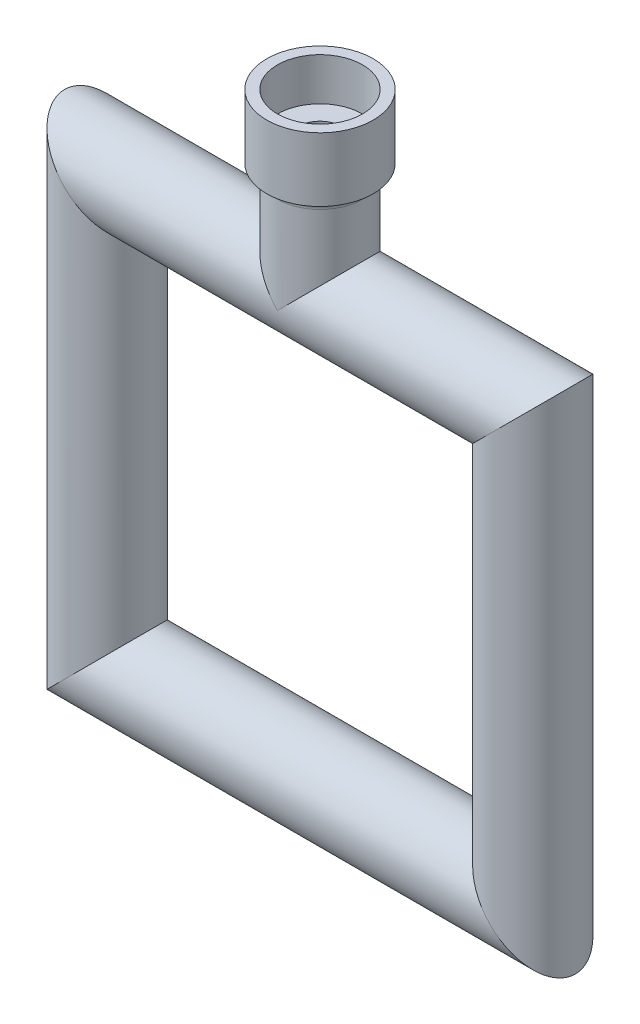
ISO-10303-21;
HEADER;
FILE_DESCRIPTION(('STEP AP214'),'2;1');
FILE_NAME('part.step','',(''),(''),'','','');
FILE_SCHEMA(('AUTOMOTIVE_DESIGN { 1 0 10303 214 1 1 1 1 }'));
ENDSEC;
DATA;
#1=APPLICATION_CONTEXT('core data for automotive mechanical design processes');
#2=APPLICATION_PROTOCOL_DEFINITION('international standard','automotive_design',2000,#1);
#3=PRODUCT_CONTEXT('',#1,'mechanical');
#4=PRODUCT('Part','Part','',(#3));
#5=PRODUCT_RELATED_PRODUCT_CATEGORY('part','',(#4));
#6=PRODUCT_DEFINITION_FORMATION('','',#4);
#7=PRODUCT_DEFINITION_CONTEXT('part definition',#1,'design');
#8=PRODUCT_DEFINITION('design','',#6,#7);
#9=PRODUCT_DEFINITION_SHAPE('','',#8);
#10=(LENGTH_UNIT() NAMED_UNIT(*) SI_UNIT(.MILLI.,.METRE.));
#11=(NAMED_UNIT(*) PLANE_ANGLE_UNIT() SI_UNIT($,.RADIAN.));
#12=(NAMED_UNIT(*) SI_UNIT($,.STERADIAN.) SOLID_ANGLE_UNIT());
#13=UNCERTAINTY_MEASURE_WITH_UNIT(LENGTH_MEASURE(1.E-05),#10,'distance_accuracy_value','');
#14=(GEOMETRIC_REPRESENTATION_CONTEXT(3) GLOBAL_UNCERTAINTY_ASSIGNED_CONTEXT((#13)) GLOBAL_UNIT_ASSIGNED_CONTEXT((#10,
#11,#12)) REPRESENTATION_CONTEXT('',''));
#15=CARTESIAN_POINT('',(0.,0.,0.));
#16=DIRECTION('',(0.,0.,1.));
#17=DIRECTION('',(1.,0.,0.));
#18=AXIS2_PLACEMENT_3D('',#15,#16,#17);
#19=CARTESIAN_POINT('',(-132.062548693336,95.4082453020949,0.));
#20=DIRECTION('',(0.,-1.,0.));
#21=DIRECTION('',(0.,0.,-1.));
#22=AXIS2_PLACEMENT_3D('',#19,#20,#21);
#23=CYLINDRICAL_SURFACE('',#22,8.00000000000001);
#24=CARTESIAN_POINT('',(-132.062548693336,77.7082453020949,0.));
#25=DIRECTION('',(0.707106781186548,-0.707106781186547,0.));
#26=DIRECTION('',(0.707106781186547,0.707106781186548,0.));
#27=AXIS2_PLACEMENT_3D('',#24,#25,#26);
#28=ELLIPSE('',#27,11.3137084989848,8.00000000000001);
#29=CARTESIAN_POINT('',(-124.062548693336,85.7082453020949,0.));
#30=VERTEX_POINT('',#29);
#31=EDGE_CURVE('E82',#30,#30,#28,.F.);
#32=ORIENTED_EDGE('',*,*,#31,.F.);
#33=EDGE_LOOP('',(#32));
#34=FACE_BOUND('',#33,.T.);
#35=CARTESIAN_POINT('',(-132.062548693336,-2.29175469790497,0.));
#36=DIRECTION('',(-0.707106781186547,-0.707106781186548,0.));
#37=DIRECTION('',(-0.707106781186548,0.707106781186547,0.));
#38=AXIS2_PLACEMENT_3D('',#35,#36,#37);
#39=ELLIPSE('',#38,11.3137084989848,8.00000000000001);
#40=CARTESIAN_POINT('',(-140.062548693336,5.70824530209504,0.));
#41=VERTEX_POINT('',#40);
#42=EDGE_CURVE('E61',#41,#41,#39,.F.);
#43=ORIENTED_EDGE('',*,*,#42,.T.);
#44=EDGE_LOOP('',(#43));
#45=FACE_BOUND('',#44,.T.);
#46=ADVANCED_FACE('F44',(#34,#45),#23,.T.);
#47=CARTESIAN_POINT('',(-114.362548693336,-2.29175469790496,0.));
#48=DIRECTION('',(-1.,0.,0.));
#49=DIRECTION('',(0.,-1.,0.));
#50=AXIS2_PLACEMENT_3D('',#47,#48,#49);
#51=CYLINDRICAL_SURFACE('',#50,8.00000000000001);
#52=ORIENTED_EDGE('',*,*,#42,.F.);
#53=EDGE_LOOP('',(#52));
#54=FACE_BOUND('',#53,.T.);
#55=CARTESIAN_POINT('',(-212.062548693336,-2.29175469790503,0.));
#56=DIRECTION('',(-0.707106781186548,0.707106781186547,0.));
#57=DIRECTION('',(0.707106781186547,0.707106781186548,0.));
#58=AXIS2_PLACEMENT_3D('',#55,#56,#57);
#59=ELLIPSE('',#58,11.3137084989848,8.00000000000001);
#60=CARTESIAN_POINT('',(-204.062548693336,5.70824530209497,0.));
#61=VERTEX_POINT('',#60);
#62=EDGE_CURVE('E78',#61,#61,#59,.F.);
#63=ORIENTED_EDGE('',*,*,#62,.T.);
#64=EDGE_LOOP('',(#63));
#65=FACE_BOUND('',#64,.T.);
#66=ADVANCED_FACE('F151',(#54,#65),#51,.T.);
#67=CARTESIAN_POINT('',(-229.762548693336,77.7082453020949,0.));
#68=DIRECTION('',(1.,0.,0.));
#69=DIRECTION('',(0.,1.,0.));
#70=AXIS2_PLACEMENT_3D('',#67,#68,#69);
#71=CYLINDRICAL_SURFACE('',#70,8.00000000000001);
#72=CARTESIAN_POINT('',(-172.062548693336,70.7800420718194,3.99999999999999));
#73=CARTESIAN_POINT('',(-171.958283367898,70.7800414394666,3.99999950219344));
#74=CARTESIAN_POINT('',(-171.854008766656,70.77768018753,3.99591763199539));
#75=CARTESIAN_POINT('',(-171.646264518735,70.7683235774563,3.97964472112406));
#76=CARTESIAN_POINT('',(-171.542795269503,70.7613260619101,3.96744990521397));
#77=CARTESIAN_POINT('',(-171.337337847766,70.7429420016429,3.93508538297521));
#78=CARTESIAN_POINT('',(-171.235352259506,70.7315485739323,3.91490316893162));
#79=CARTESIAN_POINT('',(-171.033734691657,70.7047855676199,3.86682062971257));
#80=CARTESIAN_POINT('',(-170.934103755293,70.689414261375,3.83891695064121));
#81=CARTESIAN_POINT('',(-170.640859727327,70.6382798842373,3.74442772916633));
#82=CARTESIAN_POINT('',(-170.451562836719,70.5973662542617,3.66684915651284));
#83=CARTESIAN_POINT('',(-170.088819129535,70.5065360225742,3.48506075380107));
#84=CARTESIAN_POINT('',(-169.915373171116,70.4566189338563,3.38084948302615));
#85=CARTESIAN_POINT('',(-169.573340198988,70.3483730394541,3.13867639492104));
#86=CARTESIAN_POINT('',(-169.406333826888,70.2896900191959,2.99863981046007));
#87=CARTESIAN_POINT('',(-169.096893452686,70.1733587244371,2.69298354883074));
#88=CARTESIAN_POINT('',(-168.954471707572,70.1157109788448,2.52735118809492));
#89=CARTESIAN_POINT('',(-168.757566626854,70.0323693664984,2.2562643781099));
#90=CARTESIAN_POINT('',(-168.693016431717,70.0042961096927,2.15870290429514));
#91=CARTESIAN_POINT('',(-168.572444253108,69.9508033641343,1.95777427065882));
#92=CARTESIAN_POINT('',(-168.516418647327,69.925382749659,1.85440960246323));
#93=CARTESIAN_POINT('',(-168.413435911678,69.8779237029121,1.64251485422606));
#94=CARTESIAN_POINT('',(-168.366478640746,69.85588521803,1.53398485456801));
#95=CARTESIAN_POINT('',(-168.28218674507,69.8158591047757,1.31258580967488));
#96=CARTESIAN_POINT('',(-168.244846705646,69.7978691977025,1.19971924732414));
#97=CARTESIAN_POINT('',(-168.182530399061,69.767599566188,0.978622575683235));
#98=CARTESIAN_POINT('',(-168.156866540277,69.7550060020258,0.870629018183683));
#99=CARTESIAN_POINT('',(-168.114568985902,69.7341494634817,0.652524088435713));
#100=CARTESIAN_POINT('',(-168.09793087182,69.7258843701956,0.542413779814401));
#101=CARTESIAN_POINT('',(-168.073892826338,69.713918142569,0.320973525125326));
#102=CARTESIAN_POINT('',(-168.06649024662,69.7102156998776,0.209643937931218));
#103=CARTESIAN_POINT('',(-168.061017006966,69.7074797016465,-0.0132971447801825));
#104=CARTESIAN_POINT('',(-168.062945776091,69.7084458604578,-0.124908622632323));
#105=CARTESIAN_POINT('',(-168.075533902043,69.7147316974531,-0.33772798534243));
#106=CARTESIAN_POINT('',(-168.085416715685,69.7196641180081,-0.438993817716943));
#107=CARTESIAN_POINT('',(-168.112811972432,69.7332665019751,-0.640243249291355));
#108=CARTESIAN_POINT('',(-168.130326872472,69.7419376689614,-0.740226424897066));
#109=CARTESIAN_POINT('',(-168.19405921603,69.7732733471094,-1.03714138295469));
#110=CARTESIAN_POINT('',(-168.251476590337,69.8012665413868,-1.23123936013571));
#111=CARTESIAN_POINT('',(-168.394882667221,69.8693825769154,-1.60926871560141));
#112=CARTESIAN_POINT('',(-168.481255675739,69.9096678786622,-1.79302228049015));
#113=CARTESIAN_POINT('',(-168.679600627807,69.998739224807,-2.14389861654609));
#114=CARTESIAN_POINT('',(-168.79158173615,70.0475283111047,-2.31101540282593));
#115=CARTESIAN_POINT('',(-169.050133613333,70.1544699033993,-2.64069813790284));
#116=CARTESIAN_POINT('',(-169.198973453489,70.2130715576811,-2.80134064782814));
#117=CARTESIAN_POINT('',(-169.520894936522,70.3300703821172,-3.09641313015099));
#118=CARTESIAN_POINT('',(-169.69399505616,70.3884673613146,-3.23082293513641));
#119=CARTESIAN_POINT('',(-170.073191582004,70.5024841740141,-3.47803613314162));
#120=CARTESIAN_POINT('',(-170.280685311883,70.5576921482639,-3.58892539602577));
#121=CARTESIAN_POINT('',(-170.605966077775,70.6293760479291,-3.72723782010753));
#122=CARTESIAN_POINT('',(-170.716757052533,70.6514193636003,-3.76867730715225));
#123=CARTESIAN_POINT('',(-170.942293540117,70.6909323057295,-3.84175062064905));
#124=CARTESIAN_POINT('',(-171.057036565862,70.7084047512665,-3.87339049322798));
#125=CARTESIAN_POINT('',(-171.280377357853,70.7368392761062,-3.92431909326375));
#126=CARTESIAN_POINT('',(-171.388747344796,70.7482057320169,-3.94438433855718));
#127=CARTESIAN_POINT('',(-171.607129593814,70.7659419466536,-3.97551851361913));
#128=CARTESIAN_POINT('',(-171.71714097147,70.7723143038045,-3.98659212183613));
#129=CARTESIAN_POINT('',(-171.937841203368,70.7797971829957,-3.99958291311108));
#130=CARTESIAN_POINT('',(-172.048529789963,70.7809096643432,-4.00150350567567));
#131=CARTESIAN_POINT('',(-172.269605386441,70.7778299103454,-3.99616718095744));
#132=CARTESIAN_POINT('',(-172.379992416178,70.7736380330655,-3.98891088315149));
#133=CARTESIAN_POINT('',(-172.587418077315,70.7608733300611,-3.96663154579714));
#134=CARTESIAN_POINT('',(-172.684591904348,70.7528318888324,-3.95254845698989));
#135=CARTESIAN_POINT('',(-172.87728062677,70.7329615753745,-3.91737385475212));
#136=CARTESIAN_POINT('',(-172.972794963372,70.7211314525079,-3.89628002700135));
#137=CARTESIAN_POINT('',(-173.255916729444,70.6804884430794,-3.82280238446313));
#138=CARTESIAN_POINT('',(-173.440240127608,70.6465136651611,-3.76020731695077));
#139=CARTESIAN_POINT('',(-173.804223281037,70.5667953691745,-3.60658595732553));
#140=CARTESIAN_POINT('',(-173.983271646675,70.5205796586267,-3.51437713951605));
#141=CARTESIAN_POINT('',(-174.324418890023,70.4220004359063,-3.30514737086265));
#142=CARTESIAN_POINT('',(-174.486508996644,70.3696337717905,-3.18811367399406));
#143=CARTESIAN_POINT('',(-174.810461816194,70.256726935925,-2.91535761342626));
#144=CARTESIAN_POINT('',(-174.969720280502,70.1959885511683,-2.75661800037807));
#145=CARTESIAN_POINT('',(-175.260214666752,70.0788693255175,-2.41358105803053));
#146=CARTESIAN_POINT('',(-175.391441122952,70.0224899606482,-2.22927513013697));
#147=CARTESIAN_POINT('',(-175.565756475573,69.9448898627111,-1.93419225408144));
#148=CARTESIAN_POINT('',(-175.620678750635,69.9199017600682,-1.83122945254022));
#149=CARTESIAN_POINT('',(-175.721554224213,69.8733034628416,-1.62028527572797));
#150=CARTESIAN_POINT('',(-175.767511456474,69.8516917499559,-1.51230618469742));
#151=CARTESIAN_POINT('',(-175.849923019976,69.8124937819428,-1.29213403393067));
#152=CARTESIAN_POINT('',(-175.886381851515,69.7949056209582,-1.17994299872754));
#153=CARTESIAN_POINT('',(-175.949355954282,69.7642845927613,-0.952197786601984));
#154=CARTESIAN_POINT('',(-175.97587240463,69.7512511853883,-0.836644010238128));
#155=CARTESIAN_POINT('',(-176.016620743283,69.731127810837,-0.613942900584697));
#156=CARTESIAN_POINT('',(-176.031758166112,69.7236014624309,-0.506999857370271));
#157=CARTESIAN_POINT('',(-176.053340806688,69.7128508048039,-0.291983714868727));
#158=CARTESIAN_POINT('',(-176.059783129707,69.7096279282774,-0.183910251308578));
#159=CARTESIAN_POINT('',(-176.063878835421,69.7075803383906,0.0323692027916302));
#160=CARTESIAN_POINT('',(-176.06153830492,69.7087525790707,0.140575049615288));
#161=CARTESIAN_POINT('',(-176.04811102251,69.7154564588488,0.356345776551111));
#162=CARTESIAN_POINT('',(-176.037021065472,69.7209896954851,0.463910407218418));
#163=CARTESIAN_POINT('',(-176.007254715945,69.7357582516915,0.670402230454414));
#164=CARTESIAN_POINT('',(-175.989130844632,69.7447234126341,0.769428771379722));
#165=CARTESIAN_POINT('',(-175.945578755848,69.7661064717151,0.965494016558233));
#166=CARTESIAN_POINT('',(-175.920148044162,69.7785255488131,1.06253202988244));
#167=CARTESIAN_POINT('',(-175.833262097585,69.8205549391269,1.34967669515382));
#168=CARTESIAN_POINT('',(-175.761187153176,69.8549507612641,1.535990515319));
#169=CARTESIAN_POINT('',(-175.587634916055,69.9352098402071,1.90172389087137));
#170=CARTESIAN_POINT('',(-175.485031921002,69.9815006430211,2.08050775123498));
#171=CARTESIAN_POINT('',(-175.254716449163,70.0807199475304,2.41909138351715));
#172=CARTESIAN_POINT('',(-175.126992439703,70.1336514938325,2.57888238184508));
#173=CARTESIAN_POINT('',(-174.835368556458,70.2470990743441,2.89165430996829));
#174=CARTESIAN_POINT('',(-174.6691334665,70.3078456699643,3.04237488708291));
#175=CARTESIAN_POINT('',(-174.312711055164,70.4257299339999,3.31466901461283));
#176=CARTESIAN_POINT('',(-174.122502768086,70.482864376931,3.43621677845464));
#177=CARTESIAN_POINT('',(-173.819172957183,70.5615149743789,3.59554085555899));
#178=CARTESIAN_POINT('',(-173.713247625067,70.5868957157142,3.64540546855454));
#179=CARTESIAN_POINT('',(-173.496744316371,70.6339415256285,3.73588341660289));
#180=CARTESIAN_POINT('',(-173.386168771274,70.6556085066871,3.77650151690076));
#181=CARTESIAN_POINT('',(-173.161422393903,70.6943090952248,3.84790167044829));
#182=CARTESIAN_POINT('',(-173.047261658868,70.711354605176,3.87870902746064));
#183=CARTESIAN_POINT('',(-172.816074977759,70.7401270239027,3.93016568856617));
#184=CARTESIAN_POINT('',(-172.699051095248,70.7518576508056,3.95082209480823));
#185=CARTESIAN_POINT('',(-172.495350383792,70.767064973204,3.97745846425996));
#186=CARTESIAN_POINT('',(-172.409089320354,70.7719195464748,3.98590343866332));
#187=CARTESIAN_POINT('',(-172.23607056535,70.778408466601,3.99717460159987));
#188=CARTESIAN_POINT('',(-172.14931284095,70.7800425980303,4.00000041424856));
#189=CARTESIAN_POINT('',(-172.062548693336,70.7800420718194,3.99999999999999));
#190=B_SPLINE_CURVE_WITH_KNOTS('',3,(#72,#73,#74,#75,#76,#77,#78,#79,#80,#81,#82,#83,#84,#85,
#86,#87,#88,#89,#90,#91,#92,#93,#94,#95,#96,#97,#98,#99,#100,#101,#102,#103,#104,#105,#106,#107,
#108,#109,#110,#111,#112,#113,#114,#115,#116,#117,#118,#119,#120,#121,#122,#123,#124,#125,#126,
#127,#128,#129,#130,#131,#132,#133,#134,#135,#136,#137,#138,#139,#140,#141,#142,#143,#144,#145,
#146,#147,#148,#149,#150,#151,#152,#153,#154,#155,#156,#157,#158,#159,#160,#161,#162,#163,#164,
#165,#166,#167,#168,#169,#170,#171,#172,#173,#174,#175,#176,#177,#178,#179,#180,#181,#182,#183,
#184,#185,#186,#187,#188,#189),.UNSPECIFIED.,.T.,.F.,(4,2,2,2,2,2,2,2,2,2,2,2,2,2,2,2,2,2,2,2,2,
2,2,2,2,2,2,2,2,2,2,2,2,2,2,2,2,2,2,2,2,2,2,2,2,2,2,2,2,2,2,2,2,2,2,2,2,2,4),(0.,
0.312705907645182,0.625557430139051,0.938900807369715,1.25238050266336,1.87532331508722,
2.49829983322607,3.17265818143841,3.8473517748203,4.20786878872691,4.56823217961299,
4.92858996431117,5.28874441516655,5.62343001077675,5.95795161516747,6.29237727234832,
6.62678246790365,6.93200651230819,7.23732888766058,7.84737748897725,8.46586637752492,
9.08457696228991,9.76177264655466,10.4394869181158,11.1602386574569,11.5207615871967,
11.8810616378013,12.2129840588139,12.5447336660446,12.8763596865808,13.2079633222265,
13.5031682056197,13.7984706362685,14.38866539675,15.006195155551,15.6240427481094,
16.319773042532,17.0157378984356,17.3733524504477,17.7308057238246,18.0880893282017,
18.44533054695,18.7697157004161,19.0942088199643,19.4184770967801,19.7428642161658,
20.0457160884446,20.3486714633267,20.9540518089476,21.5853244972459,22.2168876724958,
22.9113041424697,23.6063321822732,23.9652997079033,24.3240818165631,24.6819309195695,
25.0395292944428,25.2997293817866,25.5599468741983),.UNSPECIFIED.);
#191=CARTESIAN_POINT('',(-172.062548693336,70.7800420718194,3.99999999999999));
#192=VERTEX_POINT('',#191);
#193=EDGE_CURVE('E105',#192,#192,#190,.T.);
#194=ORIENTED_EDGE('',*,*,#193,.T.);
#195=EDGE_LOOP('',(#194));
#196=FACE_BOUND('',#195,.T.);
#197=CARTESIAN_POINT('',(-172.062548693336,77.7082453020949,0.));
#198=DIRECTION('',(0.707106781186548,-0.707106781186547,0.));
#199=DIRECTION('',(0.707106781186547,0.707106781186548,0.));
#200=AXIS2_PLACEMENT_3D('',#197,#198,#199);
#201=ELLIPSE('',#200,11.3137084989848,8.);
#202=CARTESIAN_POINT('',(-172.062548693336,77.7082453020949,8.));
#203=VERTEX_POINT('',#202);
#204=CARTESIAN_POINT('',(-172.062548693336,77.7082453020949,-8.));
#205=VERTEX_POINT('',#204);
#206=EDGE_CURVE('E12',#203,#205,#201,.F.);
#207=ORIENTED_EDGE('',*,*,#206,.F.);
#208=CARTESIAN_POINT('',(-172.062548693336,77.7082453020949,0.));
#209=DIRECTION('',(0.707106781186547,0.707106781186548,0.));
#210=DIRECTION('',(0.707106781186548,-0.707106781186547,0.));
#211=AXIS2_PLACEMENT_3D('',#208,#209,#210);
#212=ELLIPSE('',#211,11.3137084989848,8.);
#213=EDGE_CURVE('E51',#205,#203,#212,.T.);
#214=ORIENTED_EDGE('',*,*,#213,.F.);
#215=EDGE_LOOP('',(#207,#214));
#216=FACE_BOUND('',#215,.T.);
#217=CARTESIAN_POINT('',(-212.062548693336,77.708245302095,0.));
#218=DIRECTION('',(0.707106781186547,0.707106781186548,0.));
#219=DIRECTION('',(-0.707106781186548,0.707106781186547,0.));
#220=AXIS2_PLACEMENT_3D('',#217,#218,#219);
#221=ELLIPSE('',#220,11.3137084989848,8.00000000000001);
#222=CARTESIAN_POINT('',(-220.062548693336,85.708245302095,0.));
#223=VERTEX_POINT('',#222);
#224=EDGE_CURVE('E76',#223,#223,#221,.F.);
#225=ORIENTED_EDGE('',*,*,#224,.F.);
#226=EDGE_LOOP('',(#225));
#227=FACE_BOUND('',#226,.T.);
#228=ORIENTED_EDGE('',*,*,#31,.T.);
#229=EDGE_LOOP('',(#228));
#230=FACE_BOUND('',#229,.T.);
#231=ADVANCED_FACE('F72',(#196,#216,#227,#230),#71,.T.);
#232=CARTESIAN_POINT('',(-212.062548693336,-19.9917546979051,0.));
#233=DIRECTION('',(0.,1.,0.));
#234=DIRECTION('',(0.,0.,1.));
#235=AXIS2_PLACEMENT_3D('',#232,#233,#234);
#236=CYLINDRICAL_SURFACE('',#235,8.00000000000001);
#237=ORIENTED_EDGE('',*,*,#62,.F.);
#238=EDGE_LOOP('',(#237));
#239=FACE_BOUND('',#238,.T.);
#240=ORIENTED_EDGE('',*,*,#224,.T.);
#241=EDGE_LOOP('',(#240));
#242=FACE_BOUND('',#241,.T.);
#243=ADVANCED_FACE('F145',(#239,#242),#236,.T.);
#244=CARTESIAN_POINT('',(-172.062548693336,29.5523789677077,0.));
#245=DIRECTION('',(0.,-1.,0.));
#246=DIRECTION('',(0.,0.,-1.));
#247=AXIS2_PLACEMENT_3D('',#244,#245,#246);
#248=CYLINDRICAL_SURFACE('',#247,8.);
#249=CARTESIAN_POINT('',(-172.062548693336,95.8082453020949,0.));
#250=DIRECTION('',(0.,-1.,0.));
#251=DIRECTION('',(0.,0.,-1.));
#252=AXIS2_PLACEMENT_3D('',#249,#250,#251);
#253=CIRCLE('',#252,8.);
#254=CARTESIAN_POINT('',(-172.062548693336,95.8082453020949,-8.));
#255=VERTEX_POINT('',#254);
#256=EDGE_CURVE('E83',#255,#255,#253,.T.);
#257=ORIENTED_EDGE('',*,*,#256,.T.);
#258=EDGE_LOOP('',(#257));
#259=FACE_BOUND('',#258,.T.);
#260=ORIENTED_EDGE('',*,*,#213,.T.);
#261=ORIENTED_EDGE('',*,*,#206,.T.);
#262=EDGE_LOOP('',(#260,#261));
#263=FACE_BOUND('',#262,.T.);
#264=ADVANCED_FACE('F75',(#259,#263),#248,.T.);
#265=CARTESIAN_POINT('',(-172.062548693336,95.8082453020949,0.));
#266=DIRECTION('',(0.,-1.,0.));
#267=DIRECTION('',(0.,0.,-1.));
#268=AXIS2_PLACEMENT_3D('',#265,#266,#267);
#269=TOROIDAL_SURFACE('',#268,9.9,1.9);
#270=CARTESIAN_POINT('',(-172.062548693336,97.7082453020949,0.));
#271=DIRECTION('',(0.,-1.,0.));
#272=DIRECTION('',(0.,0.,-1.));
#273=AXIS2_PLACEMENT_3D('',#270,#271,#272);
#274=CIRCLE('',#273,9.90000000000001);
#275=CARTESIAN_POINT('',(-172.062548693336,97.7082453020949,-9.90000000000001));
#276=VERTEX_POINT('',#275);
#277=EDGE_CURVE('E89',#276,#276,#274,.T.);
#278=ORIENTED_EDGE('',*,*,#277,.T.);
#279=EDGE_LOOP('',(#278));
#280=FACE_BOUND('',#279,.T.);
#281=ORIENTED_EDGE('',*,*,#256,.F.);
#282=EDGE_LOOP('',(#281));
#283=FACE_BOUND('',#282,.T.);
#284=ADVANCED_FACE('F138',(#280,#283),#269,.F.);
#285=CARTESIAN_POINT('',(-172.062548693336,97.7082453020949,-9.99999999999999));
#286=DIRECTION('',(0.,-1.,0.));
#287=DIRECTION('',(0.,0.,-1.));
#288=AXIS2_PLACEMENT_3D('',#285,#286,#287);
#289=PLANE('',#288);
#290=CARTESIAN_POINT('',(-172.062548693336,97.7082453020949,0.));
#291=DIRECTION('',(0.,-1.,0.));
#292=DIRECTION('',(0.,0.,-1.));
#293=AXIS2_PLACEMENT_3D('',#290,#291,#292);
#294=CIRCLE('',#293,9.99999999999999);
#295=CARTESIAN_POINT('',(-172.062548693336,97.7082453020949,-9.99999999999999));
#296=VERTEX_POINT('',#295);
#297=EDGE_CURVE('E92',#296,#296,#294,.T.);
#298=ORIENTED_EDGE('',*,*,#297,.T.);
#299=EDGE_LOOP('',(#298));
#300=FACE_BOUND('',#299,.T.);
#301=ORIENTED_EDGE('',*,*,#277,.F.);
#302=EDGE_LOOP('',(#301));
#303=FACE_BOUND('',#302,.T.);
#304=ADVANCED_FACE('F134',(#300,#303),#289,.T.);
#305=CARTESIAN_POINT('',(-172.062548693336,29.5523789677077,0.));
#306=DIRECTION('',(0.,-1.,0.));
#307=DIRECTION('',(0.,0.,-1.));
#308=AXIS2_PLACEMENT_3D('',#305,#306,#307);
#309=CYLINDRICAL_SURFACE('',#308,9.99999999999999);
#310=CARTESIAN_POINT('',(-172.062548693336,109.708245302095,0.));
#311=DIRECTION('',(0.,-1.,0.));
#312=DIRECTION('',(0.,0.,-1.));
#313=AXIS2_PLACEMENT_3D('',#310,#311,#312);
#314=CIRCLE('',#313,9.99999999999999);
#315=CARTESIAN_POINT('',(-172.062548693336,109.708245302095,-9.99999999999999));
#316=VERTEX_POINT('',#315);
#317=EDGE_CURVE('E95',#316,#316,#314,.T.);
#318=ORIENTED_EDGE('',*,*,#317,.T.);
#319=EDGE_LOOP('',(#318));
#320=FACE_BOUND('',#319,.T.);
#321=ORIENTED_EDGE('',*,*,#297,.F.);
#322=EDGE_LOOP('',(#321));
#323=FACE_BOUND('',#322,.T.);
#324=ADVANCED_FACE('F130',(#320,#323),#309,.T.);
#325=CARTESIAN_POINT('',(-172.062548693336,109.708245302095,-7.99999999999999));
#326=DIRECTION('',(0.,1.,0.));
#327=DIRECTION('',(0.,0.,1.));
#328=AXIS2_PLACEMENT_3D('',#325,#326,#327);
#329=PLANE('',#328);
#330=CARTESIAN_POINT('',(-172.062548693336,109.708245302095,0.));
#331=DIRECTION('',(0.,-1.,0.));
#332=DIRECTION('',(0.,0.,-1.));
#333=AXIS2_PLACEMENT_3D('',#330,#331,#332);
#334=CIRCLE('',#333,7.99999999999999);
#335=CARTESIAN_POINT('',(-172.062548693336,109.708245302095,-7.99999999999999));
#336=VERTEX_POINT('',#335);
#337=EDGE_CURVE('E98',#336,#336,#334,.T.);
#338=ORIENTED_EDGE('',*,*,#337,.T.);
#339=EDGE_LOOP('',(#338));
#340=FACE_BOUND('',#339,.T.);
#341=ORIENTED_EDGE('',*,*,#317,.F.);
#342=EDGE_LOOP('',(#341));
#343=FACE_BOUND('',#342,.T.);
#344=ADVANCED_FACE('F126',(#340,#343),#329,.T.);
#345=CARTESIAN_POINT('',(-172.062548693336,29.5523789677077,0.));
#346=DIRECTION('',(0.,-1.,0.));
#347=DIRECTION('',(0.,0.,-1.));
#348=AXIS2_PLACEMENT_3D('',#345,#346,#347);
#349=CYLINDRICAL_SURFACE('',#348,7.99999999999999);
#350=CARTESIAN_POINT('',(-172.062548693336,101.708245302095,0.));
#351=DIRECTION('',(0.,-1.,0.));
#352=DIRECTION('',(0.,0.,-1.));
#353=AXIS2_PLACEMENT_3D('',#350,#351,#352);
#354=CIRCLE('',#353,8.);
#355=CARTESIAN_POINT('',(-172.062548693336,101.708245302095,-8.));
#356=VERTEX_POINT('',#355);
#357=EDGE_CURVE('E101',#356,#356,#354,.T.);
#358=ORIENTED_EDGE('',*,*,#357,.T.);
#359=EDGE_LOOP('',(#358));
#360=FACE_BOUND('',#359,.T.);
#361=ORIENTED_EDGE('',*,*,#337,.F.);
#362=EDGE_LOOP('',(#361));
#363=FACE_BOUND('',#362,.T.);
#364=ADVANCED_FACE('F122',(#360,#363),#349,.F.);
#365=CARTESIAN_POINT('',(-172.062548693336,101.708245302095,0.));
#366=DIRECTION('',(0.,1.,0.));
#367=DIRECTION('',(0.,0.,1.));
#368=AXIS2_PLACEMENT_3D('',#365,#366,#367);
#369=PLANE('',#368);
#370=CARTESIAN_POINT('',(-172.062548693336,101.708245302095,0.));
#371=DIRECTION('',(0.,1.,0.));
#372=DIRECTION('',(0.,0.,1.));
#373=AXIS2_PLACEMENT_3D('',#370,#371,#372);
#374=CIRCLE('',#373,3.99999999999999);
#375=CARTESIAN_POINT('',(-172.062548693336,101.708245302095,3.99999999999999));
#376=VERTEX_POINT('',#375);
#377=EDGE_CURVE('E104',#376,#376,#374,.T.);
#378=ORIENTED_EDGE('',*,*,#377,.F.);
#379=EDGE_LOOP('',(#378));
#380=FACE_BOUND('',#379,.T.);
#381=ORIENTED_EDGE('',*,*,#357,.F.);
#382=EDGE_LOOP('',(#381));
#383=FACE_BOUND('',#382,.T.);
#384=ADVANCED_FACE('F118',(#380,#383),#369,.T.);
#385=CARTESIAN_POINT('',(-172.062548693336,-10.292754697905,0.));
#386=DIRECTION('',(0.,1.,0.));
#387=DIRECTION('',(0.,0.,1.));
#388=AXIS2_PLACEMENT_3D('',#385,#386,#387);
#389=CYLINDRICAL_SURFACE('',#388,3.99999999999999);
#390=ORIENTED_EDGE('',*,*,#193,.F.);
#391=EDGE_LOOP('',(#390));
#392=FACE_BOUND('',#391,.T.);
#393=ORIENTED_EDGE('',*,*,#377,.T.);
#394=EDGE_LOOP('',(#393));
#395=FACE_BOUND('',#394,.T.);
#396=ADVANCED_FACE('F113',(#392,#395),#389,.F.);
#397=CLOSED_SHELL('',(#46,#66,#231,#243,#264,#284,#304,#324,#344,#364,#384,#396));
#398=MANIFOLD_SOLID_BREP('B2',#397);
#399=ADVANCED_BREP_SHAPE_REPRESENTATION('',(#18,#398),#14);
#400=SHAPE_DEFINITION_REPRESENTATION(#9,#399);
ENDSEC;
END-ISO-10303-21;
